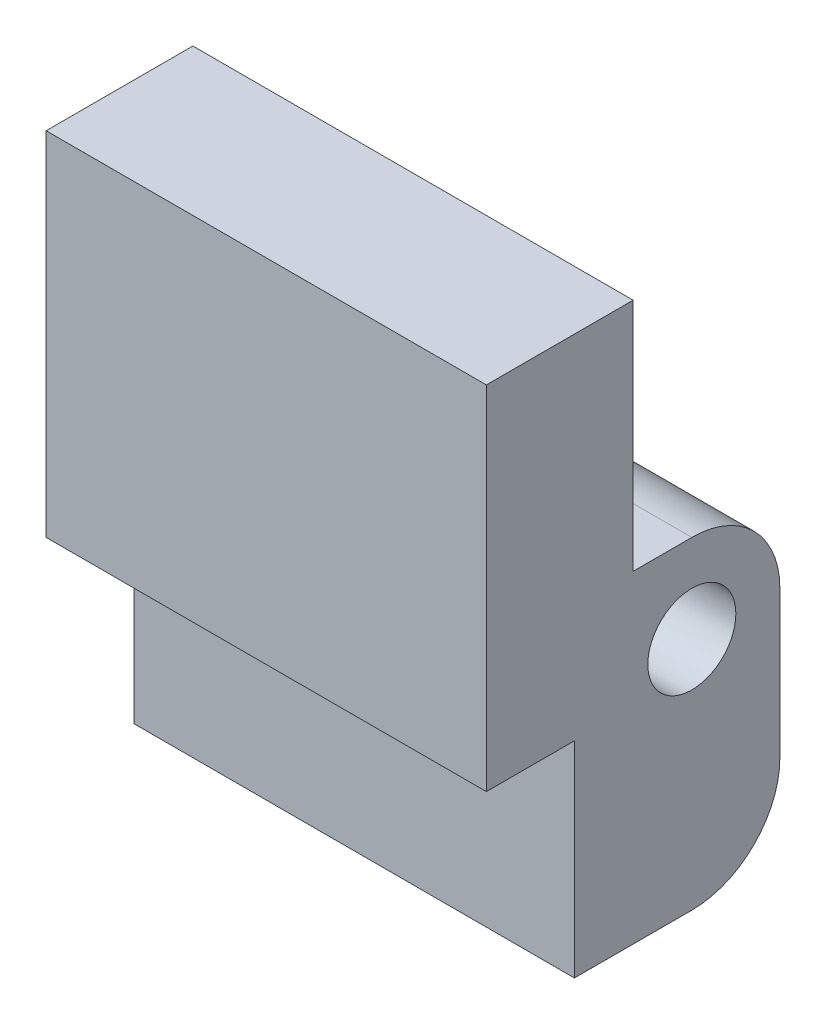
ISO-10303-21;
HEADER;
FILE_DESCRIPTION(('STEP AP214'),'2;1');
FILE_NAME('part.step','',(''),(''),'','','');
FILE_SCHEMA(('AUTOMOTIVE_DESIGN { 1 0 10303 214 1 1 1 1 }'));
ENDSEC;
DATA;
#1=APPLICATION_CONTEXT('core data for automotive mechanical design processes');
#2=APPLICATION_PROTOCOL_DEFINITION('international standard','automotive_design',2000,#1);
#3=PRODUCT_CONTEXT('',#1,'mechanical');
#4=PRODUCT('Part','Part','',(#3));
#5=PRODUCT_RELATED_PRODUCT_CATEGORY('part','',(#4));
#6=PRODUCT_DEFINITION_FORMATION('','',#4);
#7=PRODUCT_DEFINITION_CONTEXT('part definition',#1,'design');
#8=PRODUCT_DEFINITION('design','',#6,#7);
#9=PRODUCT_DEFINITION_SHAPE('','',#8);
#10=(LENGTH_UNIT() NAMED_UNIT(*) SI_UNIT(.MILLI.,.METRE.));
#11=(NAMED_UNIT(*) PLANE_ANGLE_UNIT() SI_UNIT($,.RADIAN.));
#12=(NAMED_UNIT(*) SI_UNIT($,.STERADIAN.) SOLID_ANGLE_UNIT());
#13=UNCERTAINTY_MEASURE_WITH_UNIT(LENGTH_MEASURE(1.E-05),#10,'distance_accuracy_value','');
#14=(GEOMETRIC_REPRESENTATION_CONTEXT(3) GLOBAL_UNCERTAINTY_ASSIGNED_CONTEXT((#13)) GLOBAL_UNIT_ASSIGNED_CONTEXT((#10,
#11,#12)) REPRESENTATION_CONTEXT('',''));
#15=CARTESIAN_POINT('',(0.,0.,0.));
#16=DIRECTION('',(0.,0.,1.));
#17=DIRECTION('',(1.,0.,0.));
#18=AXIS2_PLACEMENT_3D('',#15,#16,#17);
#19=CARTESIAN_POINT('',(15.,-10.8732394366197,-4.85211267605634));
#20=DIRECTION('',(1.,0.,0.));
#21=DIRECTION('',(0.,0.,-1.));
#22=AXIS2_PLACEMENT_3D('',#19,#20,#21);
#23=PLANE('',#22);
#24=DIRECTION('',(0.,-1.,0.));
#25=VECTOR('',#24,1.);
#26=CARTESIAN_POINT('',(15.,5.12676056338028,2.14788732394366));
#27=LINE('',#26,#25);
#28=CARTESIAN_POINT('',(15.,5.12676056338028,2.14788732394366));
#29=VERTEX_POINT('',#28);
#30=CARTESIAN_POINT('',(15.,-6.87323943661972,2.14788732394366));
#31=VERTEX_POINT('',#30);
#32=EDGE_CURVE('E161',#29,#31,#27,.T.);
#33=ORIENTED_EDGE('',*,*,#32,.T.);
#34=DIRECTION('',(0.,0.,-1.));
#35=VECTOR('',#34,1.);
#36=CARTESIAN_POINT('',(15.,-6.87323943661972,2.14788732394366));
#37=LINE('',#36,#35);
#38=CARTESIAN_POINT('',(15.,-6.87323943661972,-0.852112676056342));
#39=VERTEX_POINT('',#38);
#40=EDGE_CURVE('E99',#31,#39,#37,.T.);
#41=ORIENTED_EDGE('',*,*,#40,.T.);
#42=DIRECTION('',(0.,-1.,0.));
#43=VECTOR('',#42,1.);
#44=CARTESIAN_POINT('',(15.,-6.87323943661972,-0.852112676056342));
#45=LINE('',#44,#43);
#46=CARTESIAN_POINT('',(15.,-13.8732394366197,-0.852112676056344));
#47=VERTEX_POINT('',#46);
#48=EDGE_CURVE('E182',#39,#47,#45,.T.);
#49=ORIENTED_EDGE('',*,*,#48,.T.);
#50=DIRECTION('',(0.,0.,-1.));
#51=VECTOR('',#50,1.);
#52=CARTESIAN_POINT('',(15.,-13.8732394366197,-0.852112676056344));
#53=LINE('',#52,#51);
#54=CARTESIAN_POINT('',(15.,-13.8732394366197,-4.85211267605632));
#55=VERTEX_POINT('',#54);
#56=EDGE_CURVE('E201',#47,#55,#53,.T.);
#57=ORIENTED_EDGE('',*,*,#56,.T.);
#58=CARTESIAN_POINT('',(15.,-10.8732394366197,-4.85211267605634));
#59=DIRECTION('',(1.,0.,0.));
#60=DIRECTION('',(0.,0.,-1.));
#61=AXIS2_PLACEMENT_3D('',#58,#59,#60);
#62=CIRCLE('',#61,3.);
#63=CARTESIAN_POINT('',(15.,-10.8732394366197,-7.85211267605634));
#64=VERTEX_POINT('',#63);
#65=EDGE_CURVE('E198',#55,#64,#62,.T.);
#66=ORIENTED_EDGE('',*,*,#65,.T.);
#67=DIRECTION('',(0.,1.,0.));
#68=VECTOR('',#67,1.);
#69=CARTESIAN_POINT('',(15.,-5.87323943661974,-7.85211267605634));
#70=LINE('',#69,#68);
#71=CARTESIAN_POINT('',(15.,-5.87323943661974,-7.85211267605634));
#72=VERTEX_POINT('',#71);
#73=EDGE_CURVE('E200',#64,#72,#70,.T.);
#74=ORIENTED_EDGE('',*,*,#73,.T.);
#75=CARTESIAN_POINT('',(15.,-5.87323943661972,-4.85211267605634));
#76=DIRECTION('',(1.,0.,0.));
#77=DIRECTION('',(0.,0.,1.));
#78=AXIS2_PLACEMENT_3D('',#75,#76,#77);
#79=CIRCLE('',#78,3.);
#80=CARTESIAN_POINT('',(15.,-2.87323943661972,-4.85211267605632));
#81=VERTEX_POINT('',#80);
#82=EDGE_CURVE('E124',#72,#81,#79,.T.);
#83=ORIENTED_EDGE('',*,*,#82,.T.);
#84=DIRECTION('',(0.,0.,1.));
#85=VECTOR('',#84,1.);
#86=CARTESIAN_POINT('',(15.,-2.87323943661972,-2.85211267605634));
#87=LINE('',#86,#85);
#88=CARTESIAN_POINT('',(15.,-2.87323943661972,-2.85211267605634));
#89=VERTEX_POINT('',#88);
#90=EDGE_CURVE('E118',#81,#89,#87,.T.);
#91=ORIENTED_EDGE('',*,*,#90,.T.);
#92=DIRECTION('',(0.,1.,0.));
#93=VECTOR('',#92,1.);
#94=CARTESIAN_POINT('',(15.,5.12676056338028,-2.85211267605634));
#95=LINE('',#94,#93);
#96=CARTESIAN_POINT('',(15.,5.12676056338028,-2.85211267605634));
#97=VERTEX_POINT('',#96);
#98=EDGE_CURVE('E122',#89,#97,#95,.T.);
#99=ORIENTED_EDGE('',*,*,#98,.T.);
#100=DIRECTION('',(0.,0.,1.));
#101=VECTOR('',#100,1.);
#102=CARTESIAN_POINT('',(15.,5.12676056338028,2.14788732394366));
#103=LINE('',#102,#101);
#104=EDGE_CURVE('E50',#97,#29,#103,.T.);
#105=ORIENTED_EDGE('',*,*,#104,.T.);
#106=EDGE_LOOP('',(#33,#41,#49,#57,#66,#74,#83,#91,#99,#105));
#107=FACE_BOUND('',#106,.T.);
#108=CARTESIAN_POINT('',(15.,-5.87323943661972,-4.85211267605634));
#109=DIRECTION('',(1.,0.,0.));
#110=DIRECTION('',(0.,0.,-1.));
#111=AXIS2_PLACEMENT_3D('',#108,#109,#110);
#112=CIRCLE('',#111,1.5);
#113=CARTESIAN_POINT('',(15.,-5.87323943661972,-6.35211267605634));
#114=VERTEX_POINT('',#113);
#115=EDGE_CURVE('E146',#114,#114,#112,.T.);
#116=ORIENTED_EDGE('',*,*,#115,.F.);
#117=EDGE_LOOP('',(#116));
#118=FACE_BOUND('',#117,.T.);
#119=ADVANCED_FACE('F33',(#107,#118),#23,.T.);
#120=CARTESIAN_POINT('',(0.,-10.8732394366197,-4.85211267605634));
#121=DIRECTION('',(1.,0.,0.));
#122=DIRECTION('',(0.,0.,-1.));
#123=AXIS2_PLACEMENT_3D('',#120,#121,#122);
#124=PLANE('',#123);
#125=DIRECTION('',(0.,-1.,0.));
#126=VECTOR('',#125,1.);
#127=CARTESIAN_POINT('',(0.,5.12676056338028,2.14788732394366));
#128=LINE('',#127,#126);
#129=CARTESIAN_POINT('',(0.,5.12676056338028,2.14788732394366));
#130=VERTEX_POINT('',#129);
#131=CARTESIAN_POINT('',(0.,-6.87323943661972,2.14788732394366));
#132=VERTEX_POINT('',#131);
#133=EDGE_CURVE('E142',#130,#132,#128,.T.);
#134=ORIENTED_EDGE('',*,*,#133,.F.);
#135=DIRECTION('',(0.,0.,1.));
#136=VECTOR('',#135,1.);
#137=CARTESIAN_POINT('',(0.,5.12676056338028,2.14788732394366));
#138=LINE('',#137,#136);
#139=CARTESIAN_POINT('',(0.,5.12676056338028,-2.85211267605634));
#140=VERTEX_POINT('',#139);
#141=EDGE_CURVE('E91',#140,#130,#138,.T.);
#142=ORIENTED_EDGE('',*,*,#141,.F.);
#143=DIRECTION('',(0.,1.,0.));
#144=VECTOR('',#143,1.);
#145=CARTESIAN_POINT('',(0.,5.12676056338028,-2.85211267605634));
#146=LINE('',#145,#144);
#147=CARTESIAN_POINT('',(0.,-2.87323943661972,-2.85211267605634));
#148=VERTEX_POINT('',#147);
#149=EDGE_CURVE('E85',#148,#140,#146,.T.);
#150=ORIENTED_EDGE('',*,*,#149,.F.);
#151=DIRECTION('',(0.,0.,1.));
#152=VECTOR('',#151,1.);
#153=CARTESIAN_POINT('',(0.,-2.87323943661972,-2.85211267605634));
#154=LINE('',#153,#152);
#155=CARTESIAN_POINT('',(0.,-2.87323943661972,-4.85211267605632));
#156=VERTEX_POINT('',#155);
#157=EDGE_CURVE('E132',#156,#148,#154,.T.);
#158=ORIENTED_EDGE('',*,*,#157,.F.);
#159=CARTESIAN_POINT('',(0.,-5.87323943661972,-4.85211267605634));
#160=DIRECTION('',(1.,0.,0.));
#161=DIRECTION('',(0.,0.,1.));
#162=AXIS2_PLACEMENT_3D('',#159,#160,#161);
#163=CIRCLE('',#162,3.);
#164=CARTESIAN_POINT('',(0.,-5.87323943661974,-7.85211267605634));
#165=VERTEX_POINT('',#164);
#166=EDGE_CURVE('E156',#165,#156,#163,.T.);
#167=ORIENTED_EDGE('',*,*,#166,.F.);
#168=DIRECTION('',(0.,1.,0.));
#169=VECTOR('',#168,1.);
#170=CARTESIAN_POINT('',(0.,-5.87323943661974,-7.85211267605634));
#171=LINE('',#170,#169);
#172=CARTESIAN_POINT('',(0.,-10.8732394366197,-7.85211267605634));
#173=VERTEX_POINT('',#172);
#174=EDGE_CURVE('E154',#173,#165,#171,.T.);
#175=ORIENTED_EDGE('',*,*,#174,.F.);
#176=CARTESIAN_POINT('',(0.,-10.8732394366197,-4.85211267605634));
#177=DIRECTION('',(1.,0.,0.));
#178=DIRECTION('',(0.,0.,-1.));
#179=AXIS2_PLACEMENT_3D('',#176,#177,#178);
#180=CIRCLE('',#179,3.);
#181=CARTESIAN_POINT('',(0.,-13.8732394366197,-4.85211267605632));
#182=VERTEX_POINT('',#181);
#183=EDGE_CURVE('E152',#182,#173,#180,.T.);
#184=ORIENTED_EDGE('',*,*,#183,.F.);
#185=DIRECTION('',(0.,0.,-1.));
#186=VECTOR('',#185,1.);
#187=CARTESIAN_POINT('',(0.,-13.8732394366197,-0.852112676056344));
#188=LINE('',#187,#186);
#189=CARTESIAN_POINT('',(0.,-13.8732394366197,-0.852112676056344));
#190=VERTEX_POINT('',#189);
#191=EDGE_CURVE('E150',#190,#182,#188,.T.);
#192=ORIENTED_EDGE('',*,*,#191,.F.);
#193=DIRECTION('',(0.,-1.,0.));
#194=VECTOR('',#193,1.);
#195=CARTESIAN_POINT('',(0.,-6.87323943661972,-0.852112676056342));
#196=LINE('',#195,#194);
#197=CARTESIAN_POINT('',(0.,-6.87323943661972,-0.852112676056342));
#198=VERTEX_POINT('',#197);
#199=EDGE_CURVE('E148',#198,#190,#196,.T.);
#200=ORIENTED_EDGE('',*,*,#199,.F.);
#201=DIRECTION('',(0.,0.,-1.));
#202=VECTOR('',#201,1.);
#203=CARTESIAN_POINT('',(0.,-6.87323943661972,2.14788732394366));
#204=LINE('',#203,#202);
#205=EDGE_CURVE('E145',#132,#198,#204,.T.);
#206=ORIENTED_EDGE('',*,*,#205,.F.);
#207=EDGE_LOOP('',(#134,#142,#150,#158,#167,#175,#184,#192,#200,#206));
#208=FACE_BOUND('',#207,.T.);
#209=CARTESIAN_POINT('',(0.,-5.87323943661972,-4.85211267605634));
#210=DIRECTION('',(1.,0.,0.));
#211=DIRECTION('',(0.,0.,-1.));
#212=AXIS2_PLACEMENT_3D('',#209,#210,#211);
#213=CIRCLE('',#212,1.5);
#214=CARTESIAN_POINT('',(0.,-5.87323943661972,-6.35211267605634));
#215=VERTEX_POINT('',#214);
#216=EDGE_CURVE('E209',#215,#215,#213,.T.);
#217=ORIENTED_EDGE('',*,*,#216,.T.);
#218=EDGE_LOOP('',(#217));
#219=FACE_BOUND('',#218,.T.);
#220=ADVANCED_FACE('F186',(#208,#219),#124,.F.);
#221=CARTESIAN_POINT('',(15.,5.12676056338028,2.14788732394366));
#222=DIRECTION('',(0.,0.,-1.));
#223=DIRECTION('',(0.,1.,0.));
#224=AXIS2_PLACEMENT_3D('',#221,#222,#223);
#225=PLANE('',#224);
#226=ORIENTED_EDGE('',*,*,#133,.T.);
#227=DIRECTION('',(-1.,0.,0.));
#228=VECTOR('',#227,1.);
#229=CARTESIAN_POINT('',(15.,-6.87323943661972,2.14788732394366));
#230=LINE('',#229,#228);
#231=EDGE_CURVE('E11',#31,#132,#230,.T.);
#232=ORIENTED_EDGE('',*,*,#231,.F.);
#233=ORIENTED_EDGE('',*,*,#32,.F.);
#234=DIRECTION('',(-1.,0.,0.));
#235=VECTOR('',#234,1.);
#236=CARTESIAN_POINT('',(15.,5.12676056338028,2.14788732394366));
#237=LINE('',#236,#235);
#238=EDGE_CURVE('E138',#29,#130,#237,.T.);
#239=ORIENTED_EDGE('',*,*,#238,.T.);
#240=EDGE_LOOP('',(#226,#232,#233,#239));
#241=FACE_BOUND('',#240,.T.);
#242=ADVANCED_FACE('F35',(#241),#225,.F.);
#243=CARTESIAN_POINT('',(15.,-6.87323943661972,2.14788732394366));
#244=DIRECTION('',(0.,1.,0.));
#245=DIRECTION('',(0.,0.,1.));
#246=AXIS2_PLACEMENT_3D('',#243,#244,#245);
#247=PLANE('',#246);
#248=ORIENTED_EDGE('',*,*,#205,.T.);
#249=DIRECTION('',(-1.,0.,0.));
#250=VECTOR('',#249,1.);
#251=CARTESIAN_POINT('',(15.,-6.87323943661972,-0.852112676056342));
#252=LINE('',#251,#250);
#253=EDGE_CURVE('E42',#39,#198,#252,.T.);
#254=ORIENTED_EDGE('',*,*,#253,.F.);
#255=ORIENTED_EDGE('',*,*,#40,.F.);
#256=ORIENTED_EDGE('',*,*,#231,.T.);
#257=EDGE_LOOP('',(#248,#254,#255,#256));
#258=FACE_BOUND('',#257,.T.);
#259=ADVANCED_FACE('F245',(#258),#247,.F.);
#260=CARTESIAN_POINT('',(15.,-6.87323943661972,-0.852112676056342));
#261=DIRECTION('',(0.,0.,-1.));
#262=DIRECTION('',(0.,1.,0.));
#263=AXIS2_PLACEMENT_3D('',#260,#261,#262);
#264=PLANE('',#263);
#265=ORIENTED_EDGE('',*,*,#199,.T.);
#266=DIRECTION('',(-1.,0.,0.));
#267=VECTOR('',#266,1.);
#268=CARTESIAN_POINT('',(15.,-13.8732394366197,-0.852112676056344));
#269=LINE('',#268,#267);
#270=EDGE_CURVE('E174',#47,#190,#269,.T.);
#271=ORIENTED_EDGE('',*,*,#270,.F.);
#272=ORIENTED_EDGE('',*,*,#48,.F.);
#273=ORIENTED_EDGE('',*,*,#253,.T.);
#274=EDGE_LOOP('',(#265,#271,#272,#273));
#275=FACE_BOUND('',#274,.T.);
#276=ADVANCED_FACE('F180',(#275),#264,.F.);
#277=CARTESIAN_POINT('',(15.,-13.8732394366197,-0.852112676056344));
#278=DIRECTION('',(0.,1.,0.));
#279=DIRECTION('',(0.,0.,1.));
#280=AXIS2_PLACEMENT_3D('',#277,#278,#279);
#281=PLANE('',#280);
#282=ORIENTED_EDGE('',*,*,#191,.T.);
#283=DIRECTION('',(-1.,0.,0.));
#284=VECTOR('',#283,1.);
#285=CARTESIAN_POINT('',(15.,-13.8732394366197,-4.85211267605632));
#286=LINE('',#285,#284);
#287=EDGE_CURVE('E171',#55,#182,#286,.T.);
#288=ORIENTED_EDGE('',*,*,#287,.F.);
#289=ORIENTED_EDGE('',*,*,#56,.F.);
#290=ORIENTED_EDGE('',*,*,#270,.T.);
#291=EDGE_LOOP('',(#282,#288,#289,#290));
#292=FACE_BOUND('',#291,.T.);
#293=ADVANCED_FACE('F192',(#292),#281,.F.);
#294=CARTESIAN_POINT('',(15.,-10.8732394366197,-4.85211267605634));
#295=DIRECTION('',(-1.,0.,0.));
#296=DIRECTION('',(0.,0.,1.));
#297=AXIS2_PLACEMENT_3D('',#294,#295,#296);
#298=CYLINDRICAL_SURFACE('',#297,3.);
#299=ORIENTED_EDGE('',*,*,#183,.T.);
#300=DIRECTION('',(-1.,0.,0.));
#301=VECTOR('',#300,1.);
#302=CARTESIAN_POINT('',(15.,-10.8732394366197,-7.85211267605634));
#303=LINE('',#302,#301);
#304=EDGE_CURVE('E168',#64,#173,#303,.T.);
#305=ORIENTED_EDGE('',*,*,#304,.F.);
#306=ORIENTED_EDGE('',*,*,#65,.F.);
#307=ORIENTED_EDGE('',*,*,#287,.T.);
#308=EDGE_LOOP('',(#299,#305,#306,#307));
#309=FACE_BOUND('',#308,.T.);
#310=ADVANCED_FACE('F196',(#309),#298,.T.);
#311=CARTESIAN_POINT('',(15.,-5.87323943661974,-7.85211267605634));
#312=DIRECTION('',(0.,0.,1.));
#313=DIRECTION('',(0.,-1.,0.));
#314=AXIS2_PLACEMENT_3D('',#311,#312,#313);
#315=PLANE('',#314);
#316=ORIENTED_EDGE('',*,*,#174,.T.);
#317=DIRECTION('',(-1.,0.,0.));
#318=VECTOR('',#317,1.);
#319=CARTESIAN_POINT('',(15.,-5.87323943661974,-7.85211267605634));
#320=LINE('',#319,#318);
#321=EDGE_CURVE('E165',#72,#165,#320,.T.);
#322=ORIENTED_EDGE('',*,*,#321,.F.);
#323=ORIENTED_EDGE('',*,*,#73,.F.);
#324=ORIENTED_EDGE('',*,*,#304,.T.);
#325=EDGE_LOOP('',(#316,#322,#323,#324));
#326=FACE_BOUND('',#325,.T.);
#327=ADVANCED_FACE('F235',(#326),#315,.F.);
#328=CARTESIAN_POINT('',(15.,-5.87323943661972,-4.85211267605634));
#329=DIRECTION('',(-1.,0.,0.));
#330=DIRECTION('',(0.,0.,1.));
#331=AXIS2_PLACEMENT_3D('',#328,#329,#330);
#332=CYLINDRICAL_SURFACE('',#331,3.);
#333=ORIENTED_EDGE('',*,*,#166,.T.);
#334=DIRECTION('',(-1.,0.,0.));
#335=VECTOR('',#334,1.);
#336=CARTESIAN_POINT('',(15.,-2.87323943661972,-4.85211267605632));
#337=LINE('',#336,#335);
#338=EDGE_CURVE('E133',#81,#156,#337,.T.);
#339=ORIENTED_EDGE('',*,*,#338,.F.);
#340=ORIENTED_EDGE('',*,*,#82,.F.);
#341=ORIENTED_EDGE('',*,*,#321,.T.);
#342=EDGE_LOOP('',(#333,#339,#340,#341));
#343=FACE_BOUND('',#342,.T.);
#344=ADVANCED_FACE('F232',(#343),#332,.T.);
#345=CARTESIAN_POINT('',(15.,-2.87323943661972,-2.85211267605634));
#346=DIRECTION('',(0.,-1.,0.));
#347=DIRECTION('',(0.,0.,-1.));
#348=AXIS2_PLACEMENT_3D('',#345,#346,#347);
#349=PLANE('',#348);
#350=ORIENTED_EDGE('',*,*,#157,.T.);
#351=DIRECTION('',(-1.,0.,0.));
#352=VECTOR('',#351,1.);
#353=CARTESIAN_POINT('',(15.,-2.87323943661972,-2.85211267605634));
#354=LINE('',#353,#352);
#355=EDGE_CURVE('E129',#89,#148,#354,.T.);
#356=ORIENTED_EDGE('',*,*,#355,.F.);
#357=ORIENTED_EDGE('',*,*,#90,.F.);
#358=ORIENTED_EDGE('',*,*,#338,.T.);
#359=EDGE_LOOP('',(#350,#356,#357,#358));
#360=FACE_BOUND('',#359,.T.);
#361=ADVANCED_FACE('F130',(#360),#349,.F.);
#362=CARTESIAN_POINT('',(15.,5.12676056338028,-2.85211267605634));
#363=DIRECTION('',(0.,0.,1.));
#364=DIRECTION('',(0.,-1.,0.));
#365=AXIS2_PLACEMENT_3D('',#362,#363,#364);
#366=PLANE('',#365);
#367=ORIENTED_EDGE('',*,*,#149,.T.);
#368=DIRECTION('',(-1.,0.,0.));
#369=VECTOR('',#368,1.);
#370=CARTESIAN_POINT('',(15.,5.12676056338028,-2.85211267605634));
#371=LINE('',#370,#369);
#372=EDGE_CURVE('E134',#97,#140,#371,.T.);
#373=ORIENTED_EDGE('',*,*,#372,.F.);
#374=ORIENTED_EDGE('',*,*,#98,.F.);
#375=ORIENTED_EDGE('',*,*,#355,.T.);
#376=EDGE_LOOP('',(#367,#373,#374,#375));
#377=FACE_BOUND('',#376,.T.);
#378=ADVANCED_FACE('F136',(#377),#366,.F.);
#379=CARTESIAN_POINT('',(15.,5.12676056338028,2.14788732394366));
#380=DIRECTION('',(0.,-1.,0.));
#381=DIRECTION('',(0.,0.,-1.));
#382=AXIS2_PLACEMENT_3D('',#379,#380,#381);
#383=PLANE('',#382);
#384=ORIENTED_EDGE('',*,*,#141,.T.);
#385=ORIENTED_EDGE('',*,*,#238,.F.);
#386=ORIENTED_EDGE('',*,*,#104,.F.);
#387=ORIENTED_EDGE('',*,*,#372,.T.);
#388=EDGE_LOOP('',(#384,#385,#386,#387));
#389=FACE_BOUND('',#388,.T.);
#390=ADVANCED_FACE('F225',(#389),#383,.F.);
#391=CARTESIAN_POINT('',(15.,-5.87323943661972,-4.85211267605634));
#392=DIRECTION('',(-1.,0.,0.));
#393=DIRECTION('',(0.,0.,1.));
#394=AXIS2_PLACEMENT_3D('',#391,#392,#393);
#395=CYLINDRICAL_SURFACE('',#394,1.5);
#396=ORIENTED_EDGE('',*,*,#115,.T.);
#397=EDGE_LOOP('',(#396));
#398=FACE_BOUND('',#397,.T.);
#399=ORIENTED_EDGE('',*,*,#216,.F.);
#400=EDGE_LOOP('',(#399));
#401=FACE_BOUND('',#400,.T.);
#402=ADVANCED_FACE('F215',(#398,#401),#395,.F.);
#403=CLOSED_SHELL('',(#119,#220,#242,#259,#276,#293,#310,#327,#344,#361,#378,#390,#402));
#404=MANIFOLD_SOLID_BREP('B2',#403);
#405=ADVANCED_BREP_SHAPE_REPRESENTATION('',(#18,#404),#14);
#406=SHAPE_DEFINITION_REPRESENTATION(#9,#405);
ENDSEC;
END-ISO-10303-21;
